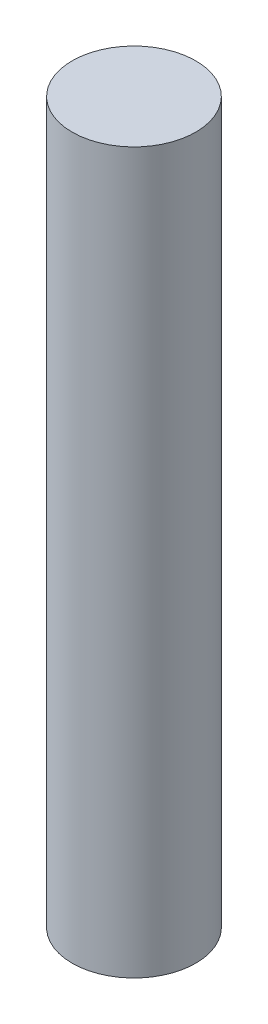
ISO-10303-21;
HEADER;
FILE_DESCRIPTION(('STEP AP214'),'2;1');
FILE_NAME('part.step','',(''),(''),'','','');
FILE_SCHEMA(('AUTOMOTIVE_DESIGN { 1 0 10303 214 1 1 1 1 }'));
ENDSEC;
DATA;
#1=APPLICATION_CONTEXT('core data for automotive mechanical design processes');
#2=APPLICATION_PROTOCOL_DEFINITION('international standard','automotive_design',2000,#1);
#3=PRODUCT_CONTEXT('',#1,'mechanical');
#4=PRODUCT('Part','Part','',(#3));
#5=PRODUCT_RELATED_PRODUCT_CATEGORY('part','',(#4));
#6=PRODUCT_DEFINITION_FORMATION('','',#4);
#7=PRODUCT_DEFINITION_CONTEXT('part definition',#1,'design');
#8=PRODUCT_DEFINITION('design','',#6,#7);
#9=PRODUCT_DEFINITION_SHAPE('','',#8);
#10=(LENGTH_UNIT() NAMED_UNIT(*) SI_UNIT(.MILLI.,.METRE.));
#11=(NAMED_UNIT(*) PLANE_ANGLE_UNIT() SI_UNIT($,.RADIAN.));
#12=(NAMED_UNIT(*) SI_UNIT($,.STERADIAN.) SOLID_ANGLE_UNIT());
#13=UNCERTAINTY_MEASURE_WITH_UNIT(LENGTH_MEASURE(1.E-05),#10,'distance_accuracy_value','');
#14=(GEOMETRIC_REPRESENTATION_CONTEXT(3) GLOBAL_UNCERTAINTY_ASSIGNED_CONTEXT((#13)) GLOBAL_UNIT_ASSIGNED_CONTEXT((#10,
#11,#12)) REPRESENTATION_CONTEXT('',''));
#15=CARTESIAN_POINT('',(0.,0.,0.));
#16=DIRECTION('',(0.,0.,1.));
#17=DIRECTION('',(1.,0.,0.));
#18=AXIS2_PLACEMENT_3D('',#15,#16,#17);
#19=CARTESIAN_POINT('',(0.,42.8625,0.));
#20=DIRECTION('',(0.,-1.,0.));
#21=DIRECTION('',(0.,0.,-1.));
#22=AXIS2_PLACEMENT_3D('',#19,#20,#21);
#23=CYLINDRICAL_SURFACE('',#22,3.68046);
#24=CARTESIAN_POINT('',(0.,42.8625,0.));
#25=DIRECTION('',(0.,1.,0.));
#26=DIRECTION('',(0.,0.,1.));
#27=AXIS2_PLACEMENT_3D('',#24,#25,#26);
#28=CIRCLE('',#27,3.68046);
#29=CARTESIAN_POINT('',(0.,42.8625,3.68046));
#30=VERTEX_POINT('',#29);
#31=EDGE_CURVE('E10',#30,#30,#28,.T.);
#32=ORIENTED_EDGE('',*,*,#31,.F.);
#33=EDGE_LOOP('',(#32));
#34=FACE_BOUND('',#33,.T.);
#35=CARTESIAN_POINT('',(0.,0.,0.));
#36=DIRECTION('',(0.,1.,0.));
#37=DIRECTION('',(0.,0.,1.));
#38=AXIS2_PLACEMENT_3D('',#35,#36,#37);
#39=CIRCLE('',#38,3.68046);
#40=CARTESIAN_POINT('',(0.,0.,3.68046));
#41=VERTEX_POINT('',#40);
#42=EDGE_CURVE('E36',#41,#41,#39,.T.);
#43=ORIENTED_EDGE('',*,*,#42,.T.);
#44=EDGE_LOOP('',(#43));
#45=FACE_BOUND('',#44,.T.);
#46=ADVANCED_FACE('F33',(#34,#45),#23,.T.);
#47=CARTESIAN_POINT('',(0.,42.8625,0.));
#48=DIRECTION('',(0.,1.,0.));
#49=DIRECTION('',(0.,0.,1.));
#50=AXIS2_PLACEMENT_3D('',#47,#48,#49);
#51=PLANE('',#50);
#52=ORIENTED_EDGE('',*,*,#31,.T.);
#53=EDGE_LOOP('',(#52));
#54=FACE_BOUND('',#53,.T.);
#55=ADVANCED_FACE('F48',(#54),#51,.T.);
#56=CARTESIAN_POINT('',(0.,0.,0.));
#57=DIRECTION('',(0.,1.,0.));
#58=DIRECTION('',(0.,0.,1.));
#59=AXIS2_PLACEMENT_3D('',#56,#57,#58);
#60=PLANE('',#59);
#61=ORIENTED_EDGE('',*,*,#42,.F.);
#62=EDGE_LOOP('',(#61));
#63=FACE_BOUND('',#62,.T.);
#64=ADVANCED_FACE('F46',(#63),#60,.F.);
#65=CLOSED_SHELL('',(#46,#55,#64));
#66=MANIFOLD_SOLID_BREP('B2',#65);
#67=ADVANCED_BREP_SHAPE_REPRESENTATION('',(#18,#66),#14);
#68=SHAPE_DEFINITION_REPRESENTATION(#9,#67);
ENDSEC;
END-ISO-10303-21;
